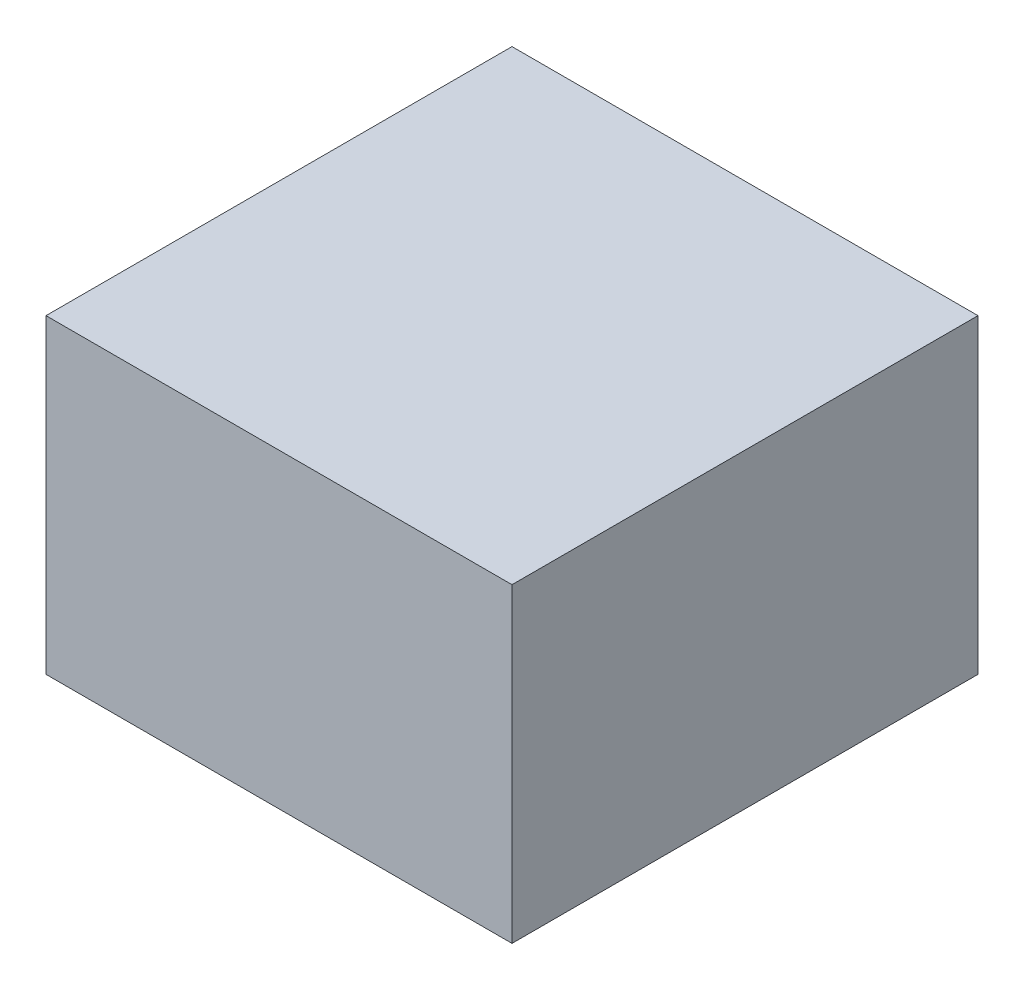
ISO-10303-21;
HEADER;
FILE_DESCRIPTION(('STEP AP214'),'2;1');
FILE_NAME('part.step','',(''),(''),'','','');
FILE_SCHEMA(('AUTOMOTIVE_DESIGN { 1 0 10303 214 1 1 1 1 }'));
ENDSEC;
DATA;
#1=APPLICATION_CONTEXT('core data for automotive mechanical design processes');
#2=APPLICATION_PROTOCOL_DEFINITION('international standard','automotive_design',2000,#1);
#3=PRODUCT_CONTEXT('',#1,'mechanical');
#4=PRODUCT('Part','Part','',(#3));
#5=PRODUCT_RELATED_PRODUCT_CATEGORY('part','',(#4));
#6=PRODUCT_DEFINITION_FORMATION('','',#4);
#7=PRODUCT_DEFINITION_CONTEXT('part definition',#1,'design');
#8=PRODUCT_DEFINITION('design','',#6,#7);
#9=PRODUCT_DEFINITION_SHAPE('','',#8);
#10=(LENGTH_UNIT() NAMED_UNIT(*) SI_UNIT(.MILLI.,.METRE.));
#11=(NAMED_UNIT(*) PLANE_ANGLE_UNIT() SI_UNIT($,.RADIAN.));
#12=(NAMED_UNIT(*) SI_UNIT($,.STERADIAN.) SOLID_ANGLE_UNIT());
#13=UNCERTAINTY_MEASURE_WITH_UNIT(LENGTH_MEASURE(1.E-05),#10,'distance_accuracy_value','');
#14=(GEOMETRIC_REPRESENTATION_CONTEXT(3) GLOBAL_UNCERTAINTY_ASSIGNED_CONTEXT((#13)) GLOBAL_UNIT_ASSIGNED_CONTEXT((#10,
#11,#12)) REPRESENTATION_CONTEXT('',''));
#15=CARTESIAN_POINT('',(0.,0.,0.));
#16=DIRECTION('',(0.,0.,1.));
#17=DIRECTION('',(1.,0.,0.));
#18=AXIS2_PLACEMENT_3D('',#15,#16,#17);
#19=CARTESIAN_POINT('',(0.,50.8,0.));
#20=DIRECTION('',(1.,0.,0.));
#21=DIRECTION('',(0.,0.,-1.));
#22=AXIS2_PLACEMENT_3D('',#19,#20,#21);
#23=PLANE('',#22);
#24=DIRECTION('',(0.,0.,1.));
#25=VECTOR('',#24,1.);
#26=CARTESIAN_POINT('',(0.,0.,0.));
#27=LINE('',#26,#25);
#28=CARTESIAN_POINT('',(0.,0.,0.));
#29=VERTEX_POINT('',#28);
#30=CARTESIAN_POINT('',(0.,0.,76.2));
#31=VERTEX_POINT('',#30);
#32=EDGE_CURVE('E103',#29,#31,#27,.T.);
#33=ORIENTED_EDGE('',*,*,#32,.T.);
#34=DIRECTION('',(0.,-1.,0.));
#35=VECTOR('',#34,1.);
#36=CARTESIAN_POINT('',(0.,50.8,76.2));
#37=LINE('',#36,#35);
#38=CARTESIAN_POINT('',(0.,50.8,76.2));
#39=VERTEX_POINT('',#38);
#40=EDGE_CURVE('E11',#39,#31,#37,.T.);
#41=ORIENTED_EDGE('',*,*,#40,.F.);
#42=DIRECTION('',(0.,0.,1.));
#43=VECTOR('',#42,1.);
#44=CARTESIAN_POINT('',(0.,50.8,0.));
#45=LINE('',#44,#43);
#46=CARTESIAN_POINT('',(0.,50.8,0.));
#47=VERTEX_POINT('',#46);
#48=EDGE_CURVE('E91',#47,#39,#45,.T.);
#49=ORIENTED_EDGE('',*,*,#48,.F.);
#50=DIRECTION('',(0.,-1.,0.));
#51=VECTOR('',#50,1.);
#52=CARTESIAN_POINT('',(0.,50.8,0.));
#53=LINE('',#52,#51);
#54=EDGE_CURVE('E99',#47,#29,#53,.T.);
#55=ORIENTED_EDGE('',*,*,#54,.T.);
#56=EDGE_LOOP('',(#33,#41,#49,#55));
#57=FACE_BOUND('',#56,.T.);
#58=ADVANCED_FACE('F40',(#57),#23,.F.);
#59=CARTESIAN_POINT('',(0.,50.8,76.2));
#60=DIRECTION('',(0.,0.,-1.));
#61=DIRECTION('',(-1.,0.,0.));
#62=AXIS2_PLACEMENT_3D('',#59,#60,#61);
#63=PLANE('',#62);
#64=DIRECTION('',(1.,0.,0.));
#65=VECTOR('',#64,1.);
#66=CARTESIAN_POINT('',(0.,0.,76.2));
#67=LINE('',#66,#65);
#68=CARTESIAN_POINT('',(76.2,0.,76.2));
#69=VERTEX_POINT('',#68);
#70=EDGE_CURVE('E95',#31,#69,#67,.T.);
#71=ORIENTED_EDGE('',*,*,#70,.T.);
#72=DIRECTION('',(0.,-1.,0.));
#73=VECTOR('',#72,1.);
#74=CARTESIAN_POINT('',(76.2,50.8,76.2));
#75=LINE('',#74,#73);
#76=CARTESIAN_POINT('',(76.2,50.8,76.2));
#77=VERTEX_POINT('',#76);
#78=EDGE_CURVE('E48',#77,#69,#75,.T.);
#79=ORIENTED_EDGE('',*,*,#78,.F.);
#80=DIRECTION('',(1.,0.,0.));
#81=VECTOR('',#80,1.);
#82=CARTESIAN_POINT('',(0.,50.8,76.2));
#83=LINE('',#82,#81);
#84=EDGE_CURVE('E86',#39,#77,#83,.T.);
#85=ORIENTED_EDGE('',*,*,#84,.F.);
#86=ORIENTED_EDGE('',*,*,#40,.T.);
#87=EDGE_LOOP('',(#71,#79,#85,#86));
#88=FACE_BOUND('',#87,.T.);
#89=ADVANCED_FACE('F94',(#88),#63,.F.);
#90=CARTESIAN_POINT('',(76.2,50.8,0.));
#91=DIRECTION('',(-1.,0.,0.));
#92=DIRECTION('',(0.,0.,1.));
#93=AXIS2_PLACEMENT_3D('',#90,#91,#92);
#94=PLANE('',#93);
#95=DIRECTION('',(0.,0.,-1.));
#96=VECTOR('',#95,1.);
#97=CARTESIAN_POINT('',(76.2,0.,0.));
#98=LINE('',#97,#96);
#99=CARTESIAN_POINT('',(76.2,0.,0.));
#100=VERTEX_POINT('',#99);
#101=EDGE_CURVE('E73',#69,#100,#98,.T.);
#102=ORIENTED_EDGE('',*,*,#101,.T.);
#103=DIRECTION('',(0.,-1.,0.));
#104=VECTOR('',#103,1.);
#105=CARTESIAN_POINT('',(76.2,50.8,0.));
#106=LINE('',#105,#104);
#107=CARTESIAN_POINT('',(76.2,50.8,0.));
#108=VERTEX_POINT('',#107);
#109=EDGE_CURVE('E96',#108,#100,#106,.T.);
#110=ORIENTED_EDGE('',*,*,#109,.F.);
#111=DIRECTION('',(0.,0.,-1.));
#112=VECTOR('',#111,1.);
#113=CARTESIAN_POINT('',(76.2,50.8,0.));
#114=LINE('',#113,#112);
#115=EDGE_CURVE('E89',#77,#108,#114,.T.);
#116=ORIENTED_EDGE('',*,*,#115,.F.);
#117=ORIENTED_EDGE('',*,*,#78,.T.);
#118=EDGE_LOOP('',(#102,#110,#116,#117));
#119=FACE_BOUND('',#118,.T.);
#120=ADVANCED_FACE('F97',(#119),#94,.F.);
#121=CARTESIAN_POINT('',(0.,50.8,0.));
#122=DIRECTION('',(0.,0.,1.));
#123=DIRECTION('',(1.,0.,0.));
#124=AXIS2_PLACEMENT_3D('',#121,#122,#123);
#125=PLANE('',#124);
#126=DIRECTION('',(-1.,0.,0.));
#127=VECTOR('',#126,1.);
#128=CARTESIAN_POINT('',(0.,0.,0.));
#129=LINE('',#128,#127);
#130=EDGE_CURVE('E79',#100,#29,#129,.T.);
#131=ORIENTED_EDGE('',*,*,#130,.T.);
#132=ORIENTED_EDGE('',*,*,#54,.F.);
#133=DIRECTION('',(-1.,0.,0.));
#134=VECTOR('',#133,1.);
#135=CARTESIAN_POINT('',(0.,50.8,0.));
#136=LINE('',#135,#134);
#137=EDGE_CURVE('E56',#108,#47,#136,.T.);
#138=ORIENTED_EDGE('',*,*,#137,.F.);
#139=ORIENTED_EDGE('',*,*,#109,.T.);
#140=EDGE_LOOP('',(#131,#132,#138,#139));
#141=FACE_BOUND('',#140,.T.);
#142=ADVANCED_FACE('F110',(#141),#125,.F.);
#143=CARTESIAN_POINT('',(0.,50.8,0.));
#144=DIRECTION('',(0.,1.,0.));
#145=DIRECTION('',(0.,0.,1.));
#146=AXIS2_PLACEMENT_3D('',#143,#144,#145);
#147=PLANE('',#146);
#148=ORIENTED_EDGE('',*,*,#48,.T.);
#149=ORIENTED_EDGE('',*,*,#84,.T.);
#150=ORIENTED_EDGE('',*,*,#115,.T.);
#151=ORIENTED_EDGE('',*,*,#137,.T.);
#152=EDGE_LOOP('',(#148,#149,#150,#151));
#153=FACE_BOUND('',#152,.T.);
#154=ADVANCED_FACE('F87',(#153),#147,.T.);
#155=CARTESIAN_POINT('',(0.,0.,0.));
#156=DIRECTION('',(0.,1.,0.));
#157=DIRECTION('',(0.,0.,1.));
#158=AXIS2_PLACEMENT_3D('',#155,#156,#157);
#159=PLANE('',#158);
#160=ORIENTED_EDGE('',*,*,#32,.F.);
#161=ORIENTED_EDGE('',*,*,#130,.F.);
#162=ORIENTED_EDGE('',*,*,#101,.F.);
#163=ORIENTED_EDGE('',*,*,#70,.F.);
#164=EDGE_LOOP('',(#160,#161,#162,#163));
#165=FACE_BOUND('',#164,.T.);
#166=ADVANCED_FACE('F113',(#165),#159,.F.);
#167=CLOSED_SHELL('',(#58,#89,#120,#142,#154,#166));
#168=MANIFOLD_SOLID_BREP('B2',#167);
#169=ADVANCED_BREP_SHAPE_REPRESENTATION('',(#18,#168),#14);
#170=SHAPE_DEFINITION_REPRESENTATION(#9,#169);
ENDSEC;
END-ISO-10303-21;
